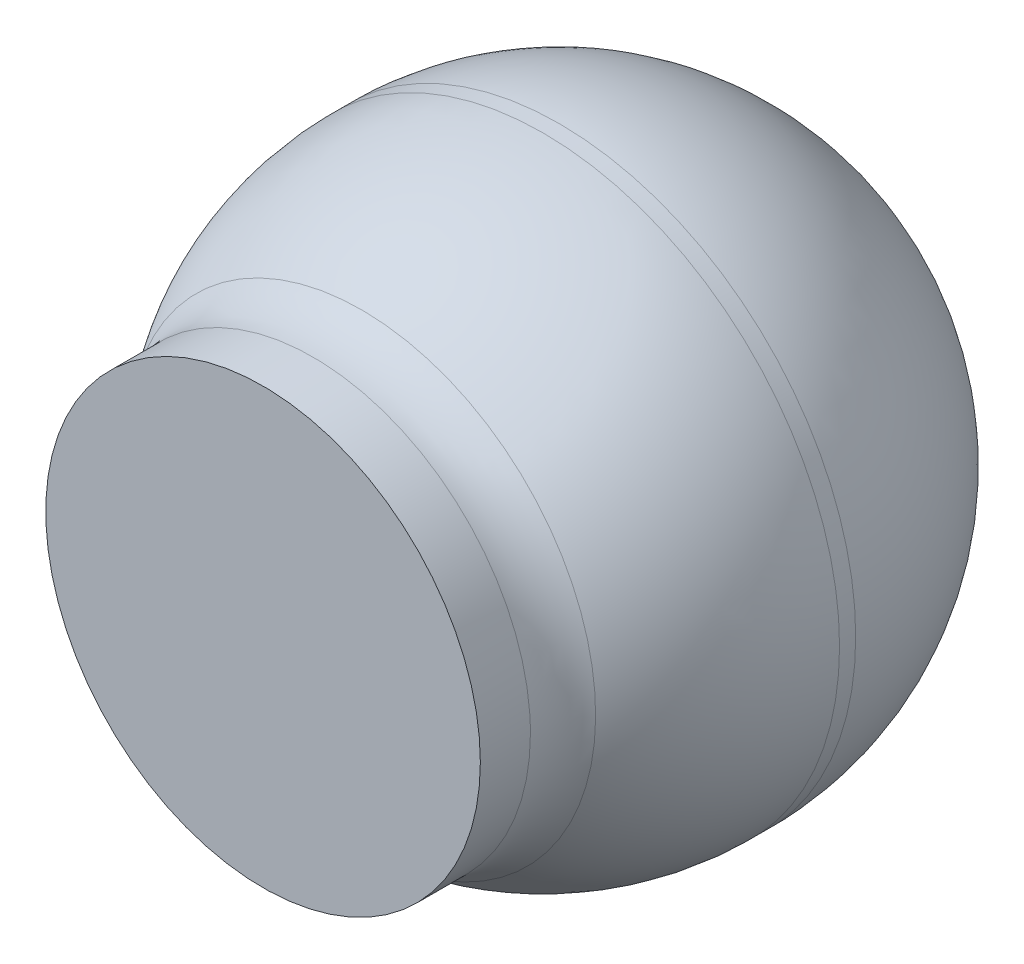
ISO-10303-21;
HEADER;
FILE_DESCRIPTION(('STEP AP214'),'2;1');
FILE_NAME('part.step','',(''),(''),'','','');
FILE_SCHEMA(('AUTOMOTIVE_DESIGN { 1 0 10303 214 1 1 1 1 }'));
ENDSEC;
DATA;
#1=APPLICATION_CONTEXT('core data for automotive mechanical design processes');
#2=APPLICATION_PROTOCOL_DEFINITION('international standard','automotive_design',2000,#1);
#3=PRODUCT_CONTEXT('',#1,'mechanical');
#4=PRODUCT('Part','Part','',(#3));
#5=PRODUCT_RELATED_PRODUCT_CATEGORY('part','',(#4));
#6=PRODUCT_DEFINITION_FORMATION('','',#4);
#7=PRODUCT_DEFINITION_CONTEXT('part definition',#1,'design');
#8=PRODUCT_DEFINITION('design','',#6,#7);
#9=PRODUCT_DEFINITION_SHAPE('','',#8);
#10=(LENGTH_UNIT() NAMED_UNIT(*) SI_UNIT(.MILLI.,.METRE.));
#11=(NAMED_UNIT(*) PLANE_ANGLE_UNIT() SI_UNIT($,.RADIAN.));
#12=(NAMED_UNIT(*) SI_UNIT($,.STERADIAN.) SOLID_ANGLE_UNIT());
#13=UNCERTAINTY_MEASURE_WITH_UNIT(LENGTH_MEASURE(1.E-05),#10,'distance_accuracy_value','');
#14=(GEOMETRIC_REPRESENTATION_CONTEXT(3) GLOBAL_UNCERTAINTY_ASSIGNED_CONTEXT((#13)) GLOBAL_UNIT_ASSIGNED_CONTEXT((#10,
#11,#12)) REPRESENTATION_CONTEXT('',''));
#15=CARTESIAN_POINT('',(0.,0.,0.));
#16=DIRECTION('',(0.,0.,1.));
#17=DIRECTION('',(1.,0.,0.));
#18=AXIS2_PLACEMENT_3D('',#15,#16,#17);
#19=CARTESIAN_POINT('',(-1.832919922269,-7.861349291452,10.006534503384));
#20=DIRECTION('',(0.,0.,-1.));
#21=DIRECTION('',(-1.,0.,0.));
#22=AXIS2_PLACEMENT_3D('',#19,#20,#21);
#23=PLANE('',#22);
#24=CARTESIAN_POINT('',(-1.832919922269,-7.861349291452,10.006534503384));
#25=DIRECTION('',(0.,0.,1.));
#26=DIRECTION('',(1.,0.,0.));
#27=AXIS2_PLACEMENT_3D('',#24,#25,#26);
#28=CIRCLE('',#27,0.275);
#29=CARTESIAN_POINT('',(-1.557919922269,-7.861349291452,10.006534503384));
#30=VERTEX_POINT('',#29);
#31=EDGE_CURVE('E20',#30,#30,#28,.F.);
#32=ORIENTED_EDGE('',*,*,#31,.F.);
#33=EDGE_LOOP('',(#32));
#34=FACE_BOUND('',#33,.T.);
#35=ADVANCED_FACE('F17',(#34),#23,.F.);
#36=CARTESIAN_POINT('',(-1.832919922269,-7.861349291452,9.906534503384));
#37=DIRECTION('',(0.,0.,1.));
#38=DIRECTION('',(1.,0.,0.));
#39=AXIS2_PLACEMENT_3D('',#36,#37,#38);
#40=CYLINDRICAL_SURFACE('',#39,0.275);
#41=CARTESIAN_POINT('',(-1.832919922269,-7.861349291452,9.943180457728));
#42=DIRECTION('',(0.,0.,-1.));
#43=DIRECTION('',(0.996700902337582,0.0811622527992469,0.));
#44=AXIS2_PLACEMENT_3D('',#41,#42,#43);
#45=CIRCLE('',#44,0.275);
#46=CARTESIAN_POINT('',(-1.55882717412616,-7.83902967193221,9.943180457728));
#47=VERTEX_POINT('',#46);
#48=EDGE_CURVE('E65',#47,#47,#45,.F.);
#49=ORIENTED_EDGE('',*,*,#48,.T.);
#50=EDGE_LOOP('',(#49));
#51=FACE_BOUND('',#50,.T.);
#52=ORIENTED_EDGE('',*,*,#31,.T.);
#53=EDGE_LOOP('',(#52));
#54=FACE_BOUND('',#53,.T.);
#55=ADVANCED_FACE('F62',(#51,#54),#40,.T.);
#56=CARTESIAN_POINT('',(-1.832919922269,-7.861349291452,9.943180457728));
#57=DIRECTION('',(0.,0.,-1.));
#58=DIRECTION('',(0.996700902337583,0.0811622527992448,0.));
#59=AXIS2_PLACEMENT_3D('',#56,#57,#58);
#60=TOROIDAL_SURFACE('',#59,0.375,0.1);
#61=ORIENTED_EDGE('',*,*,#48,.F.);
#62=EDGE_LOOP('',(#61));
#63=FACE_BOUND('',#62,.T.);
#64=CARTESIAN_POINT('',(-1.832919922269,-7.861349291452,9.881744931236));
#65=DIRECTION('',(0.,0.,-1.));
#66=DIRECTION('',(-0.996700902337597,-0.0811622527990622,0.));
#67=AXIS2_PLACEMENT_3D('',#64,#65,#66);
#68=CIRCLE('',#67,0.296097046412665);
#69=CARTESIAN_POINT('',(-2.128040115608,-7.885381194786,9.881744931236));
#70=VERTEX_POINT('',#69);
#71=EDGE_CURVE('E39',#70,#70,#68,.T.);
#72=ORIENTED_EDGE('',*,*,#71,.F.);
#73=EDGE_LOOP('',(#72));
#74=FACE_BOUND('',#73,.T.);
#75=ADVANCED_FACE('F57',(#63,#74),#60,.F.);
#76=CARTESIAN_POINT('',(-2.206682760645,-7.891785136252,9.651976062157));
#77=CARTESIAN_POINT('',(-2.206682760645,-7.891785136252,9.701461392103));
#78=CARTESIAN_POINT('',(-2.198526217348,-7.891120941579,9.750947004335));
#79=CARTESIAN_POINT('',(-2.182207085349,-7.889792059952,9.798626332798));
#80=CARTESIAN_POINT('',(-2.158341390838,-7.887848654938,9.842699544317));
#81=CARTESIAN_POINT('',(-2.128040115608,-7.885381194786,9.881744931236));
#82=(BOUNDED_CURVE() B_SPLINE_CURVE(5,(#76,#77,#78,#79,#80,#81),.UNSPECIFIED.,.F.,
.F.) B_SPLINE_CURVE_WITH_KNOTS((6,6),(0.,0.661568582165),
.UNSPECIFIED.) CURVE() GEOMETRIC_REPRESENTATION_ITEM() RATIONAL_B_SPLINE_CURVE((1.,1.,1.,1.,1.,1.)) REPRESENTATION_ITEM(''));
#83=CARTESIAN_POINT('',(-1.832919922269,-7.861349291452,9.651976062157));
#84=DIRECTION('',(0.,0.,-1.));
#85=AXIS1_PLACEMENT('',#83,#84);
#86=SURFACE_OF_REVOLUTION('',#82,#85);
#87=CARTESIAN_POINT('',(-1.832919922269,-7.861349291452,9.651976062157));
#88=DIRECTION('',(0.,0.,1.));
#89=DIRECTION('',(1.,0.,0.));
#90=AXIS2_PLACEMENT_3D('',#87,#88,#89);
#91=CIRCLE('',#90,0.375);
#92=CARTESIAN_POINT('',(-1.457919922269,-7.861349291452,9.651976062157));
#93=VERTEX_POINT('',#92);
#94=EDGE_CURVE('E36',#93,#93,#91,.F.);
#95=ORIENTED_EDGE('',*,*,#94,.F.);
#96=EDGE_LOOP('',(#95));
#97=FACE_BOUND('',#96,.T.);
#98=ORIENTED_EDGE('',*,*,#71,.T.);
#99=EDGE_LOOP('',(#98));
#100=FACE_BOUND('',#99,.T.);
#101=ADVANCED_FACE('F53',(#97,#100),#86,.F.);
#102=CARTESIAN_POINT('',(-1.832919922269,-7.861349291452,9.256534503384));
#103=DIRECTION('',(0.,0.,1.));
#104=DIRECTION('',(1.,0.,0.));
#105=AXIS2_PLACEMENT_3D('',#102,#103,#104);
#106=CYLINDRICAL_SURFACE('',#105,0.375);
#107=CARTESIAN_POINT('',(-1.832919922269,-7.861349291452,9.631534503384));
#108=DIRECTION('',(0.,0.,-1.));
#109=DIRECTION('',(0.0811622527992362,-0.996700902337583,0.));
#110=AXIS2_PLACEMENT_3D('',#107,#108,#109);
#111=CIRCLE('',#110,0.375);
#112=CARTESIAN_POINT('',(-1.80248407746929,-8.23511212982859,9.631534503384));
#113=VERTEX_POINT('',#112);
#114=CARTESIAN_POINT('',(-1.86335576706871,-7.48758645307541,9.631534503384));
#115=VERTEX_POINT('',#114);
#116=EDGE_CURVE('E11',#113,#115,#111,.T.);
#117=ORIENTED_EDGE('',*,*,#116,.F.);
#118=CARTESIAN_POINT('',(-1.832919922269,-7.861349291452,9.631534503384));
#119=DIRECTION('',(0.,0.,1.));
#120=DIRECTION('',(0.0811622527992359,-0.996700902337583,0.));
#121=AXIS2_PLACEMENT_3D('',#118,#119,#120);
#122=CIRCLE('',#121,0.375);
#123=EDGE_CURVE('E25',#115,#113,#122,.F.);
#124=ORIENTED_EDGE('',*,*,#123,.F.);
#125=EDGE_LOOP('',(#117,#124));
#126=FACE_BOUND('',#125,.T.);
#127=ORIENTED_EDGE('',*,*,#94,.T.);
#128=EDGE_LOOP('',(#127));
#129=FACE_BOUND('',#128,.T.);
#130=ADVANCED_FACE('F34',(#126,#129),#106,.T.);
#131=CARTESIAN_POINT('',(-1.832919922269,-7.861349291452,9.631534503384));
#132=DIRECTION('',(0.0811622527992361,-0.996700902337583,0.));
#133=DIRECTION('',(-0.996700902337583,-0.0811622527992361,0.));
#134=AXIS2_PLACEMENT_3D('',#131,#132,#133);
#135=SPHERICAL_SURFACE('',#134,0.375);
#136=ORIENTED_EDGE('',*,*,#123,.T.);
#137=ORIENTED_EDGE('',*,*,#116,.T.);
#138=EDGE_LOOP('',(#136,#137));
#139=FACE_BOUND('',#138,.T.);
#140=ADVANCED_FACE('F32',(#139),#135,.T.);
#141=CLOSED_SHELL('',(#35,#55,#75,#101,#130,#140));
#142=MANIFOLD_SOLID_BREP('B1',#141);
#143=ADVANCED_BREP_SHAPE_REPRESENTATION('',(#18,#142),#14);
#144=SHAPE_DEFINITION_REPRESENTATION(#9,#143);
ENDSEC;
END-ISO-10303-21;
